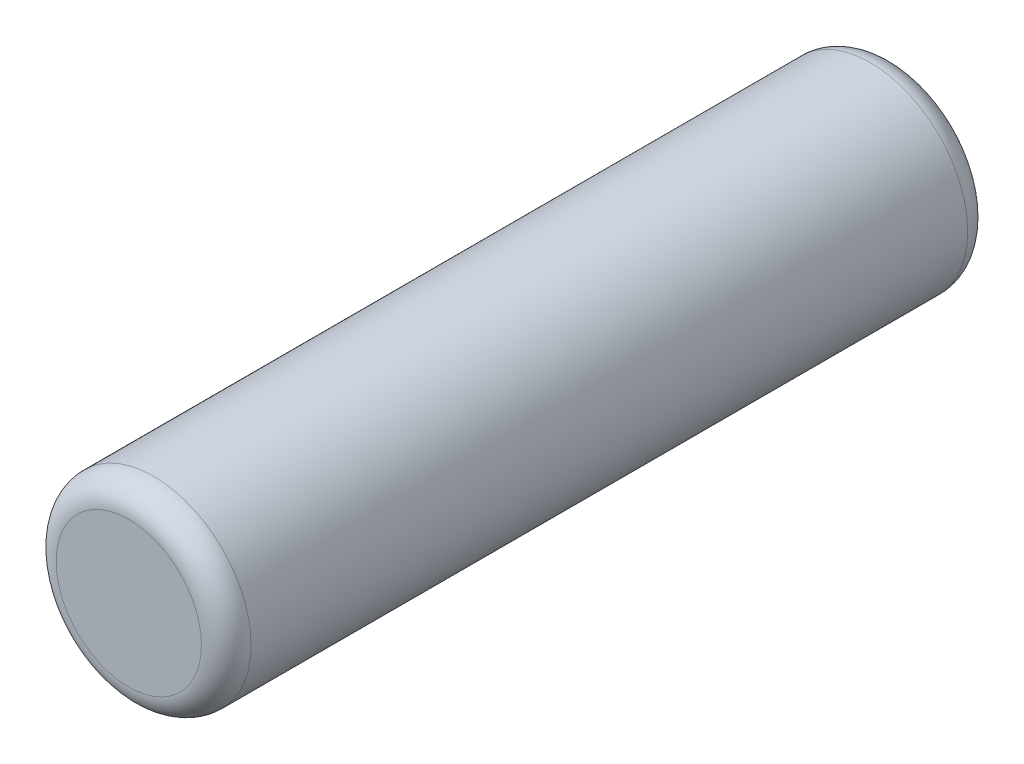
ISO-10303-21;
HEADER;
FILE_DESCRIPTION(('STEP AP214'),'2;1');
FILE_NAME('part.step','',(''),(''),'','','');
FILE_SCHEMA(('AUTOMOTIVE_DESIGN { 1 0 10303 214 1 1 1 1 }'));
ENDSEC;
DATA;
#1=APPLICATION_CONTEXT('core data for automotive mechanical design processes');
#2=APPLICATION_PROTOCOL_DEFINITION('international standard','automotive_design',2000,#1);
#3=PRODUCT_CONTEXT('',#1,'mechanical');
#4=PRODUCT('Part','Part','',(#3));
#5=PRODUCT_RELATED_PRODUCT_CATEGORY('part','',(#4));
#6=PRODUCT_DEFINITION_FORMATION('','',#4);
#7=PRODUCT_DEFINITION_CONTEXT('part definition',#1,'design');
#8=PRODUCT_DEFINITION('design','',#6,#7);
#9=PRODUCT_DEFINITION_SHAPE('','',#8);
#10=(LENGTH_UNIT() NAMED_UNIT(*) SI_UNIT(.MILLI.,.METRE.));
#11=(NAMED_UNIT(*) PLANE_ANGLE_UNIT() SI_UNIT($,.RADIAN.));
#12=(NAMED_UNIT(*) SI_UNIT($,.STERADIAN.) SOLID_ANGLE_UNIT());
#13=UNCERTAINTY_MEASURE_WITH_UNIT(LENGTH_MEASURE(1.E-05),#10,'distance_accuracy_value','');
#14=(GEOMETRIC_REPRESENTATION_CONTEXT(3) GLOBAL_UNCERTAINTY_ASSIGNED_CONTEXT((#13)) GLOBAL_UNIT_ASSIGNED_CONTEXT((#10,
#11,#12)) REPRESENTATION_CONTEXT('',''));
#15=CARTESIAN_POINT('',(0.,0.,0.));
#16=DIRECTION('',(0.,0.,1.));
#17=DIRECTION('',(1.,0.,0.));
#18=AXIS2_PLACEMENT_3D('',#15,#16,#17);
#19=CARTESIAN_POINT('',(0.,0.,7.8359));
#20=DIRECTION('',(0.,0.,-1.));
#21=DIRECTION('',(-1.,0.,0.));
#22=AXIS2_PLACEMENT_3D('',#19,#20,#21);
#23=CYLINDRICAL_SURFACE('',#22,1.9939);
#24=CARTESIAN_POINT('',(0.,0.,7.3279));
#25=DIRECTION('',(0.,0.,1.));
#26=DIRECTION('',(1.,0.,0.));
#27=AXIS2_PLACEMENT_3D('',#24,#25,#26);
#28=CIRCLE('',#27,1.9939);
#29=CARTESIAN_POINT('',(1.9939,0.,7.3279));
#30=VERTEX_POINT('',#29);
#31=EDGE_CURVE('E39',#30,#30,#28,.F.);
#32=ORIENTED_EDGE('',*,*,#31,.T.);
#33=EDGE_LOOP('',(#32));
#34=FACE_BOUND('',#33,.T.);
#35=CARTESIAN_POINT('',(0.,0.,-7.3279));
#36=DIRECTION('',(0.,0.,1.));
#37=DIRECTION('',(1.,0.,0.));
#38=AXIS2_PLACEMENT_3D('',#35,#36,#37);
#39=CIRCLE('',#38,1.9939);
#40=CARTESIAN_POINT('',(1.9939,0.,-7.3279));
#41=VERTEX_POINT('',#40);
#42=EDGE_CURVE('E43',#41,#41,#39,.T.);
#43=ORIENTED_EDGE('',*,*,#42,.T.);
#44=EDGE_LOOP('',(#43));
#45=FACE_BOUND('',#44,.T.);
#46=ADVANCED_FACE('F33',(#34,#45),#23,.T.);
#47=CARTESIAN_POINT('',(0.,0.,7.8359));
#48=DIRECTION('',(0.,0.,1.));
#49=DIRECTION('',(1.,0.,0.));
#50=AXIS2_PLACEMENT_3D('',#47,#48,#49);
#51=PLANE('',#50);
#52=CARTESIAN_POINT('',(0.,0.,7.8359));
#53=DIRECTION('',(0.,0.,1.));
#54=DIRECTION('',(1.,0.,0.));
#55=AXIS2_PLACEMENT_3D('',#52,#53,#54);
#56=CIRCLE('',#55,1.4859);
#57=CARTESIAN_POINT('',(1.4859,0.,7.8359));
#58=VERTEX_POINT('',#57);
#59=EDGE_CURVE('E47',#58,#58,#56,.T.);
#60=ORIENTED_EDGE('',*,*,#59,.T.);
#61=EDGE_LOOP('',(#60));
#62=FACE_BOUND('',#61,.T.);
#63=ADVANCED_FACE('F53',(#62),#51,.T.);
#64=CARTESIAN_POINT('',(0.,0.,-7.8359));
#65=DIRECTION('',(0.,0.,1.));
#66=DIRECTION('',(1.,0.,0.));
#67=AXIS2_PLACEMENT_3D('',#64,#65,#66);
#68=PLANE('',#67);
#69=CARTESIAN_POINT('',(0.,0.,-7.8359));
#70=DIRECTION('',(0.,0.,1.));
#71=DIRECTION('',(1.,0.,0.));
#72=AXIS2_PLACEMENT_3D('',#69,#70,#71);
#73=CIRCLE('',#72,1.4859);
#74=CARTESIAN_POINT('',(1.4859,0.,-7.8359));
#75=VERTEX_POINT('',#74);
#76=EDGE_CURVE('E10',#75,#75,#73,.F.);
#77=ORIENTED_EDGE('',*,*,#76,.T.);
#78=EDGE_LOOP('',(#77));
#79=FACE_BOUND('',#78,.T.);
#80=ADVANCED_FACE('F58',(#79),#68,.F.);
#81=CARTESIAN_POINT('',(0.,0.,7.3279));
#82=DIRECTION('',(0.,0.,1.));
#83=DIRECTION('',(1.,0.,0.));
#84=AXIS2_PLACEMENT_3D('',#81,#82,#83);
#85=TOROIDAL_SURFACE('',#84,1.4859,0.508);
#86=ORIENTED_EDGE('',*,*,#31,.F.);
#87=EDGE_LOOP('',(#86));
#88=FACE_BOUND('',#87,.T.);
#89=ORIENTED_EDGE('',*,*,#59,.F.);
#90=EDGE_LOOP('',(#89));
#91=FACE_BOUND('',#90,.T.);
#92=ADVANCED_FACE('F55',(#88,#91),#85,.T.);
#93=CARTESIAN_POINT('',(0.,0.,-7.3279));
#94=DIRECTION('',(0.,0.,1.));
#95=DIRECTION('',(1.,0.,0.));
#96=AXIS2_PLACEMENT_3D('',#93,#94,#95);
#97=TOROIDAL_SURFACE('',#96,1.4859,0.508);
#98=ORIENTED_EDGE('',*,*,#76,.F.);
#99=EDGE_LOOP('',(#98));
#100=FACE_BOUND('',#99,.T.);
#101=ORIENTED_EDGE('',*,*,#42,.F.);
#102=EDGE_LOOP('',(#101));
#103=FACE_BOUND('',#102,.T.);
#104=ADVANCED_FACE('F57',(#100,#103),#97,.T.);
#105=CLOSED_SHELL('',(#46,#63,#80,#92,#104));
#106=MANIFOLD_SOLID_BREP('B2',#105);
#107=ADVANCED_BREP_SHAPE_REPRESENTATION('',(#18,#106),#14);
#108=SHAPE_DEFINITION_REPRESENTATION(#9,#107);
ENDSEC;
END-ISO-10303-21;
